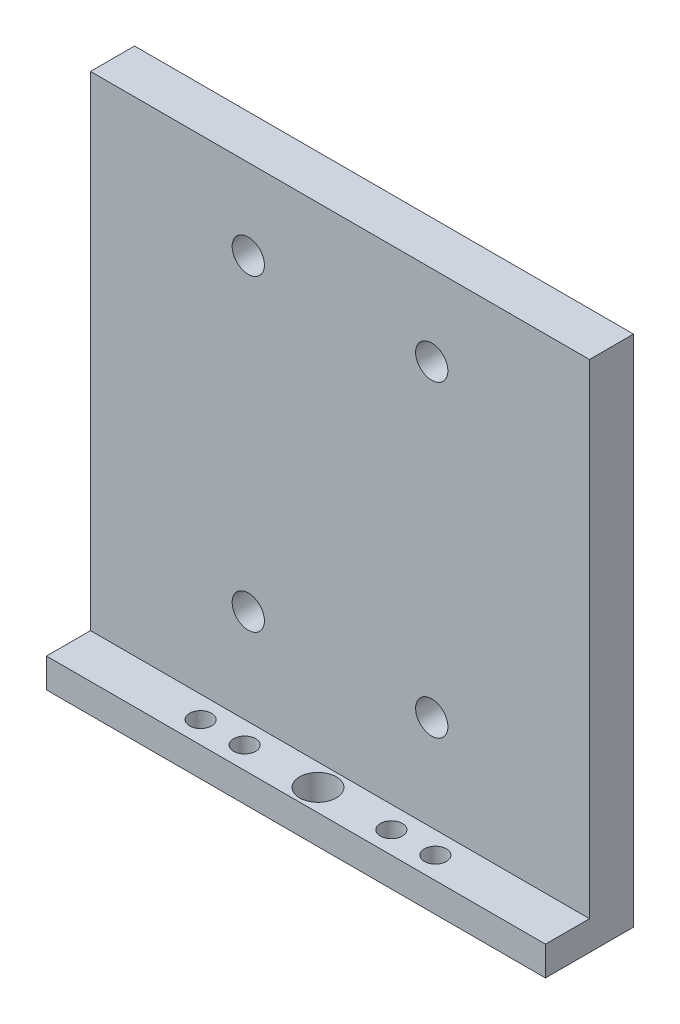
ISO-10303-21;
HEADER;
FILE_DESCRIPTION(('STEP AP214'),'2;1');
FILE_NAME('part.step','',(''),(''),'','','');
FILE_SCHEMA(('AUTOMOTIVE_DESIGN { 1 0 10303 214 1 1 1 1 }'));
ENDSEC;
DATA;
#1=APPLICATION_CONTEXT('core data for automotive mechanical design processes');
#2=APPLICATION_PROTOCOL_DEFINITION('international standard','automotive_design',2000,#1);
#3=PRODUCT_CONTEXT('',#1,'mechanical');
#4=PRODUCT('Part','Part','',(#3));
#5=PRODUCT_RELATED_PRODUCT_CATEGORY('part','',(#4));
#6=PRODUCT_DEFINITION_FORMATION('','',#4);
#7=PRODUCT_DEFINITION_CONTEXT('part definition',#1,'design');
#8=PRODUCT_DEFINITION('design','',#6,#7);
#9=PRODUCT_DEFINITION_SHAPE('','',#8);
#10=(LENGTH_UNIT() NAMED_UNIT(*) SI_UNIT(.MILLI.,.METRE.));
#11=(NAMED_UNIT(*) PLANE_ANGLE_UNIT() SI_UNIT($,.RADIAN.));
#12=(NAMED_UNIT(*) SI_UNIT($,.STERADIAN.) SOLID_ANGLE_UNIT());
#13=UNCERTAINTY_MEASURE_WITH_UNIT(LENGTH_MEASURE(1.E-05),#10,'distance_accuracy_value','');
#14=(GEOMETRIC_REPRESENTATION_CONTEXT(3) GLOBAL_UNCERTAINTY_ASSIGNED_CONTEXT((#13)) GLOBAL_UNIT_ASSIGNED_CONTEXT((#10,
#11,#12)) REPRESENTATION_CONTEXT('',''));
#15=CARTESIAN_POINT('',(0.,0.,0.));
#16=DIRECTION('',(0.,0.,1.));
#17=DIRECTION('',(1.,0.,0.));
#18=AXIS2_PLACEMENT_3D('',#15,#16,#17);
#19=CARTESIAN_POINT('',(34.,2.,0.));
#20=DIRECTION('',(0.,0.,-1.));
#21=DIRECTION('',(-1.,0.,0.));
#22=AXIS2_PLACEMENT_3D('',#19,#20,#21);
#23=PLANE('',#22);
#24=DIRECTION('',(0.,-1.,0.));
#25=VECTOR('',#24,1.);
#26=CARTESIAN_POINT('',(0.,2.,0.));
#27=LINE('',#26,#25);
#28=CARTESIAN_POINT('',(0.,2.,0.));
#29=VERTEX_POINT('',#28);
#30=CARTESIAN_POINT('',(0.,0.,0.));
#31=VERTEX_POINT('',#30);
#32=EDGE_CURVE('E120',#29,#31,#27,.T.);
#33=ORIENTED_EDGE('',*,*,#32,.T.);
#34=DIRECTION('',(-1.,0.,0.));
#35=VECTOR('',#34,1.);
#36=CARTESIAN_POINT('',(34.,0.,0.));
#37=LINE('',#36,#35);
#38=CARTESIAN_POINT('',(34.,0.,0.));
#39=VERTEX_POINT('',#38);
#40=EDGE_CURVE('E11',#39,#31,#37,.T.);
#41=ORIENTED_EDGE('',*,*,#40,.F.);
#42=DIRECTION('',(0.,-1.,0.));
#43=VECTOR('',#42,1.);
#44=CARTESIAN_POINT('',(34.,2.,0.));
#45=LINE('',#44,#43);
#46=CARTESIAN_POINT('',(34.,2.,0.));
#47=VERTEX_POINT('',#46);
#48=EDGE_CURVE('E131',#47,#39,#45,.T.);
#49=ORIENTED_EDGE('',*,*,#48,.F.);
#50=DIRECTION('',(-1.,0.,0.));
#51=VECTOR('',#50,1.);
#52=CARTESIAN_POINT('',(34.,2.,0.));
#53=LINE('',#52,#51);
#54=EDGE_CURVE('E116',#47,#29,#53,.T.);
#55=ORIENTED_EDGE('',*,*,#54,.T.);
#56=EDGE_LOOP('',(#33,#41,#49,#55));
#57=FACE_BOUND('',#56,.T.);
#58=ADVANCED_FACE('F36',(#57),#23,.F.);
#59=CARTESIAN_POINT('',(34.,0.,0.));
#60=DIRECTION('',(0.,1.,0.));
#61=DIRECTION('',(0.,0.,1.));
#62=AXIS2_PLACEMENT_3D('',#59,#60,#61);
#63=PLANE('',#62);
#64=CARTESIAN_POINT('',(9.,0.,-1.5));
#65=DIRECTION('',(0.,1.,0.));
#66=DIRECTION('',(0.,0.,1.));
#67=AXIS2_PLACEMENT_3D('',#64,#65,#66);
#68=CIRCLE('',#67,0.75);
#69=CARTESIAN_POINT('',(9.,0.,-0.75));
#70=VERTEX_POINT('',#69);
#71=EDGE_CURVE('E301',#70,#70,#68,.T.);
#72=ORIENTED_EDGE('',*,*,#71,.T.);
#73=EDGE_LOOP('',(#72));
#74=FACE_BOUND('',#73,.T.);
#75=CARTESIAN_POINT('',(12.,0.,-1.5));
#76=DIRECTION('',(0.,1.,0.));
#77=DIRECTION('',(0.,0.,1.));
#78=AXIS2_PLACEMENT_3D('',#75,#76,#77);
#79=CIRCLE('',#78,0.75);
#80=CARTESIAN_POINT('',(12.,0.,-0.75));
#81=VERTEX_POINT('',#80);
#82=EDGE_CURVE('E374',#81,#81,#79,.T.);
#83=ORIENTED_EDGE('',*,*,#82,.T.);
#84=EDGE_LOOP('',(#83));
#85=FACE_BOUND('',#84,.T.);
#86=CARTESIAN_POINT('',(25.,0.,-1.5));
#87=DIRECTION('',(0.,1.,0.));
#88=DIRECTION('',(0.,0.,1.));
#89=AXIS2_PLACEMENT_3D('',#86,#87,#88);
#90=CIRCLE('',#89,0.750000000000002);
#91=CARTESIAN_POINT('',(25.,0.,-0.749999999999998));
#92=VERTEX_POINT('',#91);
#93=EDGE_CURVE('E366',#92,#92,#90,.T.);
#94=ORIENTED_EDGE('',*,*,#93,.T.);
#95=EDGE_LOOP('',(#94));
#96=FACE_BOUND('',#95,.T.);
#97=CARTESIAN_POINT('',(22.,0.,-1.5));
#98=DIRECTION('',(0.,1.,0.));
#99=DIRECTION('',(0.,0.,1.));
#100=AXIS2_PLACEMENT_3D('',#97,#98,#99);
#101=CIRCLE('',#100,0.750000000000002);
#102=CARTESIAN_POINT('',(22.,0.,-0.749999999999998));
#103=VERTEX_POINT('',#102);
#104=EDGE_CURVE('E316',#103,#103,#101,.T.);
#105=ORIENTED_EDGE('',*,*,#104,.T.);
#106=EDGE_LOOP('',(#105));
#107=FACE_BOUND('',#106,.T.);
#108=CARTESIAN_POINT('',(17.,0.,-1.5));
#109=DIRECTION('',(0.,1.,0.));
#110=DIRECTION('',(0.,0.,1.));
#111=AXIS2_PLACEMENT_3D('',#108,#109,#110);
#112=CIRCLE('',#111,1.25);
#113=CARTESIAN_POINT('',(17.,0.,-0.250000000000002));
#114=VERTEX_POINT('',#113);
#115=EDGE_CURVE('E309',#114,#114,#112,.T.);
#116=ORIENTED_EDGE('',*,*,#115,.T.);
#117=EDGE_LOOP('',(#116));
#118=FACE_BOUND('',#117,.T.);
#119=DIRECTION('',(0.,0.,-1.));
#120=VECTOR('',#119,1.);
#121=CARTESIAN_POINT('',(0.,0.,0.));
#122=LINE('',#121,#120);
#123=CARTESIAN_POINT('',(0.,0.,-6.));
#124=VERTEX_POINT('',#123);
#125=EDGE_CURVE('E123',#31,#124,#122,.T.);
#126=ORIENTED_EDGE('',*,*,#125,.T.);
#127=DIRECTION('',(-1.,0.,0.));
#128=VECTOR('',#127,1.);
#129=CARTESIAN_POINT('',(34.,0.,-6.));
#130=LINE('',#129,#128);
#131=CARTESIAN_POINT('',(34.,0.,-6.));
#132=VERTEX_POINT('',#131);
#133=EDGE_CURVE('E44',#132,#124,#130,.T.);
#134=ORIENTED_EDGE('',*,*,#133,.F.);
#135=DIRECTION('',(0.,0.,-1.));
#136=VECTOR('',#135,1.);
#137=CARTESIAN_POINT('',(34.,0.,0.));
#138=LINE('',#137,#136);
#139=EDGE_CURVE('E89',#39,#132,#138,.T.);
#140=ORIENTED_EDGE('',*,*,#139,.F.);
#141=ORIENTED_EDGE('',*,*,#40,.T.);
#142=EDGE_LOOP('',(#126,#134,#140,#141));
#143=FACE_BOUND('',#142,.T.);
#144=ADVANCED_FACE('F159',(#74,#85,#96,#107,#118,#143),#63,.F.);
#145=CARTESIAN_POINT('',(34.,0.,-6.));
#146=DIRECTION('',(0.,0.,1.));
#147=DIRECTION('',(1.,0.,0.));
#148=AXIS2_PLACEMENT_3D('',#145,#146,#147);
#149=PLANE('',#148);
#150=CARTESIAN_POINT('',(23.25,8.5,-6.));
#151=DIRECTION('',(0.,0.,1.));
#152=DIRECTION('',(1.,0.,0.));
#153=AXIS2_PLACEMENT_3D('',#150,#151,#152);
#154=CIRCLE('',#153,1.1);
#155=CARTESIAN_POINT('',(24.35,8.5,-6.));
#156=VERTEX_POINT('',#155);
#157=EDGE_CURVE('E330',#156,#156,#154,.T.);
#158=ORIENTED_EDGE('',*,*,#157,.T.);
#159=EDGE_LOOP('',(#158));
#160=FACE_BOUND('',#159,.T.);
#161=CARTESIAN_POINT('',(10.75,8.5,-6.));
#162=DIRECTION('',(0.,0.,1.));
#163=DIRECTION('',(1.,0.,0.));
#164=AXIS2_PLACEMENT_3D('',#161,#162,#163);
#165=CIRCLE('',#164,1.1);
#166=CARTESIAN_POINT('',(11.85,8.5,-6.));
#167=VERTEX_POINT('',#166);
#168=EDGE_CURVE('E324',#167,#167,#165,.T.);
#169=ORIENTED_EDGE('',*,*,#168,.T.);
#170=EDGE_LOOP('',(#169));
#171=FACE_BOUND('',#170,.T.);
#172=CARTESIAN_POINT('',(10.75,29.5,-6.));
#173=DIRECTION('',(0.,0.,1.));
#174=DIRECTION('',(1.,0.,0.));
#175=AXIS2_PLACEMENT_3D('',#172,#173,#174);
#176=CIRCLE('',#175,1.1);
#177=CARTESIAN_POINT('',(11.85,29.5,-6.));
#178=VERTEX_POINT('',#177);
#179=EDGE_CURVE('E317',#178,#178,#176,.T.);
#180=ORIENTED_EDGE('',*,*,#179,.T.);
#181=EDGE_LOOP('',(#180));
#182=FACE_BOUND('',#181,.T.);
#183=CARTESIAN_POINT('',(23.25,29.5,-6.));
#184=DIRECTION('',(0.,0.,1.));
#185=DIRECTION('',(1.,0.,0.));
#186=AXIS2_PLACEMENT_3D('',#183,#184,#185);
#187=CIRCLE('',#186,1.1);
#188=CARTESIAN_POINT('',(24.35,29.5,-6.));
#189=VERTEX_POINT('',#188);
#190=EDGE_CURVE('E124',#189,#189,#187,.T.);
#191=ORIENTED_EDGE('',*,*,#190,.T.);
#192=EDGE_LOOP('',(#191));
#193=FACE_BOUND('',#192,.T.);
#194=DIRECTION('',(0.,1.,0.));
#195=VECTOR('',#194,1.);
#196=CARTESIAN_POINT('',(0.,0.,-6.));
#197=LINE('',#196,#195);
#198=CARTESIAN_POINT('',(0.,35.,-6.));
#199=VERTEX_POINT('',#198);
#200=EDGE_CURVE('E126',#124,#199,#197,.T.);
#201=ORIENTED_EDGE('',*,*,#200,.T.);
#202=DIRECTION('',(-1.,0.,0.));
#203=VECTOR('',#202,1.);
#204=CARTESIAN_POINT('',(34.,35.,-6.));
#205=LINE('',#204,#203);
#206=CARTESIAN_POINT('',(34.,35.,-6.));
#207=VERTEX_POINT('',#206);
#208=EDGE_CURVE('E111',#207,#199,#205,.T.);
#209=ORIENTED_EDGE('',*,*,#208,.F.);
#210=DIRECTION('',(0.,1.,0.));
#211=VECTOR('',#210,1.);
#212=CARTESIAN_POINT('',(34.,0.,-6.));
#213=LINE('',#212,#211);
#214=EDGE_CURVE('E102',#132,#207,#213,.T.);
#215=ORIENTED_EDGE('',*,*,#214,.F.);
#216=ORIENTED_EDGE('',*,*,#133,.T.);
#217=EDGE_LOOP('',(#201,#209,#215,#216));
#218=FACE_BOUND('',#217,.T.);
#219=ADVANCED_FACE('F137',(#160,#171,#182,#193,#218),#149,.F.);
#220=CARTESIAN_POINT('',(34.,35.,-6.));
#221=DIRECTION('',(0.,-1.,0.));
#222=DIRECTION('',(0.,0.,-1.));
#223=AXIS2_PLACEMENT_3D('',#220,#221,#222);
#224=PLANE('',#223);
#225=DIRECTION('',(0.,0.,1.));
#226=VECTOR('',#225,1.);
#227=CARTESIAN_POINT('',(0.,35.,-6.));
#228=LINE('',#227,#226);
#229=CARTESIAN_POINT('',(0.,35.,-3.));
#230=VERTEX_POINT('',#229);
#231=EDGE_CURVE('E110',#199,#230,#228,.T.);
#232=ORIENTED_EDGE('',*,*,#231,.T.);
#233=DIRECTION('',(-1.,0.,0.));
#234=VECTOR('',#233,1.);
#235=CARTESIAN_POINT('',(34.,35.,-3.));
#236=LINE('',#235,#234);
#237=CARTESIAN_POINT('',(34.,35.,-3.));
#238=VERTEX_POINT('',#237);
#239=EDGE_CURVE('E107',#238,#230,#236,.T.);
#240=ORIENTED_EDGE('',*,*,#239,.F.);
#241=DIRECTION('',(0.,0.,1.));
#242=VECTOR('',#241,1.);
#243=CARTESIAN_POINT('',(34.,35.,-6.));
#244=LINE('',#243,#242);
#245=EDGE_CURVE('E96',#207,#238,#244,.T.);
#246=ORIENTED_EDGE('',*,*,#245,.F.);
#247=ORIENTED_EDGE('',*,*,#208,.T.);
#248=EDGE_LOOP('',(#232,#240,#246,#247));
#249=FACE_BOUND('',#248,.T.);
#250=ADVANCED_FACE('F108',(#249),#224,.F.);
#251=CARTESIAN_POINT('',(34.,35.,-3.));
#252=DIRECTION('',(0.,0.,-1.));
#253=DIRECTION('',(0.,1.,0.));
#254=AXIS2_PLACEMENT_3D('',#251,#252,#253);
#255=PLANE('',#254);
#256=CARTESIAN_POINT('',(23.25,8.5,-3.));
#257=DIRECTION('',(0.,0.,1.));
#258=DIRECTION('',(1.,0.,0.));
#259=AXIS2_PLACEMENT_3D('',#256,#257,#258);
#260=CIRCLE('',#259,1.1);
#261=CARTESIAN_POINT('',(24.35,8.5,-3.));
#262=VERTEX_POINT('',#261);
#263=EDGE_CURVE('E312',#262,#262,#260,.T.);
#264=ORIENTED_EDGE('',*,*,#263,.F.);
#265=EDGE_LOOP('',(#264));
#266=FACE_BOUND('',#265,.T.);
#267=CARTESIAN_POINT('',(10.75,8.5,-3.));
#268=DIRECTION('',(0.,0.,1.));
#269=DIRECTION('',(1.,0.,0.));
#270=AXIS2_PLACEMENT_3D('',#267,#268,#269);
#271=CIRCLE('',#270,1.1);
#272=CARTESIAN_POINT('',(11.85,8.5,-3.));
#273=VERTEX_POINT('',#272);
#274=EDGE_CURVE('E327',#273,#273,#271,.T.);
#275=ORIENTED_EDGE('',*,*,#274,.F.);
#276=EDGE_LOOP('',(#275));
#277=FACE_BOUND('',#276,.T.);
#278=CARTESIAN_POINT('',(10.75,29.5,-3.));
#279=DIRECTION('',(0.,0.,1.));
#280=DIRECTION('',(1.,0.,0.));
#281=AXIS2_PLACEMENT_3D('',#278,#279,#280);
#282=CIRCLE('',#281,1.1);
#283=CARTESIAN_POINT('',(11.85,29.5,-3.));
#284=VERTEX_POINT('',#283);
#285=EDGE_CURVE('E321',#284,#284,#282,.T.);
#286=ORIENTED_EDGE('',*,*,#285,.F.);
#287=EDGE_LOOP('',(#286));
#288=FACE_BOUND('',#287,.T.);
#289=CARTESIAN_POINT('',(23.25,29.5,-3.));
#290=DIRECTION('',(0.,0.,1.));
#291=DIRECTION('',(1.,0.,0.));
#292=AXIS2_PLACEMENT_3D('',#289,#290,#291);
#293=CIRCLE('',#292,1.1);
#294=CARTESIAN_POINT('',(24.35,29.5,-3.));
#295=VERTEX_POINT('',#294);
#296=EDGE_CURVE('E320',#295,#295,#293,.T.);
#297=ORIENTED_EDGE('',*,*,#296,.F.);
#298=EDGE_LOOP('',(#297));
#299=FACE_BOUND('',#298,.T.);
#300=DIRECTION('',(0.,-1.,0.));
#301=VECTOR('',#300,1.);
#302=CARTESIAN_POINT('',(0.,35.,-3.));
#303=LINE('',#302,#301);
#304=CARTESIAN_POINT('',(0.,2.,-3.));
#305=VERTEX_POINT('',#304);
#306=EDGE_CURVE('E75',#230,#305,#303,.T.);
#307=ORIENTED_EDGE('',*,*,#306,.T.);
#308=DIRECTION('',(-1.,0.,0.));
#309=VECTOR('',#308,1.);
#310=CARTESIAN_POINT('',(34.,2.,-3.));
#311=LINE('',#310,#309);
#312=CARTESIAN_POINT('',(34.,2.,-3.));
#313=VERTEX_POINT('',#312);
#314=EDGE_CURVE('E112',#313,#305,#311,.T.);
#315=ORIENTED_EDGE('',*,*,#314,.F.);
#316=DIRECTION('',(0.,-1.,0.));
#317=VECTOR('',#316,1.);
#318=CARTESIAN_POINT('',(34.,35.,-3.));
#319=LINE('',#318,#317);
#320=EDGE_CURVE('E100',#238,#313,#319,.T.);
#321=ORIENTED_EDGE('',*,*,#320,.F.);
#322=ORIENTED_EDGE('',*,*,#239,.T.);
#323=EDGE_LOOP('',(#307,#315,#321,#322));
#324=FACE_BOUND('',#323,.T.);
#325=ADVANCED_FACE('F114',(#266,#277,#288,#299,#324),#255,.F.);
#326=CARTESIAN_POINT('',(34.,2.,-3.));
#327=DIRECTION('',(0.,-1.,0.));
#328=DIRECTION('',(0.,0.,-1.));
#329=AXIS2_PLACEMENT_3D('',#326,#327,#328);
#330=PLANE('',#329);
#331=CARTESIAN_POINT('',(9.,2.,-1.5));
#332=DIRECTION('',(0.,1.,0.));
#333=DIRECTION('',(0.,0.,1.));
#334=AXIS2_PLACEMENT_3D('',#331,#332,#333);
#335=CIRCLE('',#334,0.75);
#336=CARTESIAN_POINT('',(9.,2.,-0.75));
#337=VERTEX_POINT('',#336);
#338=EDGE_CURVE('E303',#337,#337,#335,.T.);
#339=ORIENTED_EDGE('',*,*,#338,.F.);
#340=EDGE_LOOP('',(#339));
#341=FACE_BOUND('',#340,.T.);
#342=CARTESIAN_POINT('',(12.,2.,-1.5));
#343=DIRECTION('',(0.,1.,0.));
#344=DIRECTION('',(0.,0.,1.));
#345=AXIS2_PLACEMENT_3D('',#342,#343,#344);
#346=CIRCLE('',#345,0.75);
#347=CARTESIAN_POINT('',(12.,2.,-0.75));
#348=VERTEX_POINT('',#347);
#349=EDGE_CURVE('E305',#348,#348,#346,.T.);
#350=ORIENTED_EDGE('',*,*,#349,.F.);
#351=EDGE_LOOP('',(#350));
#352=FACE_BOUND('',#351,.T.);
#353=CARTESIAN_POINT('',(25.,2.,-1.5));
#354=DIRECTION('',(0.,1.,0.));
#355=DIRECTION('',(0.,0.,1.));
#356=AXIS2_PLACEMENT_3D('',#353,#354,#355);
#357=CIRCLE('',#356,0.750000000000002);
#358=CARTESIAN_POINT('',(25.,2.,-0.749999999999998));
#359=VERTEX_POINT('',#358);
#360=EDGE_CURVE('E371',#359,#359,#357,.T.);
#361=ORIENTED_EDGE('',*,*,#360,.F.);
#362=EDGE_LOOP('',(#361));
#363=FACE_BOUND('',#362,.T.);
#364=CARTESIAN_POINT('',(22.,2.,-1.5));
#365=DIRECTION('',(0.,1.,0.));
#366=DIRECTION('',(0.,0.,1.));
#367=AXIS2_PLACEMENT_3D('',#364,#365,#366);
#368=CIRCLE('',#367,0.750000000000002);
#369=CARTESIAN_POINT('',(22.,2.,-0.749999999999998));
#370=VERTEX_POINT('',#369);
#371=EDGE_CURVE('E361',#370,#370,#368,.T.);
#372=ORIENTED_EDGE('',*,*,#371,.F.);
#373=EDGE_LOOP('',(#372));
#374=FACE_BOUND('',#373,.T.);
#375=CARTESIAN_POINT('',(17.,2.,-1.5));
#376=DIRECTION('',(0.,1.,0.));
#377=DIRECTION('',(0.,0.,1.));
#378=AXIS2_PLACEMENT_3D('',#375,#376,#377);
#379=CIRCLE('',#378,1.25);
#380=CARTESIAN_POINT('',(17.,2.,-0.250000000000003));
#381=VERTEX_POINT('',#380);
#382=EDGE_CURVE('E313',#381,#381,#379,.T.);
#383=ORIENTED_EDGE('',*,*,#382,.F.);
#384=EDGE_LOOP('',(#383));
#385=FACE_BOUND('',#384,.T.);
#386=DIRECTION('',(0.,0.,1.));
#387=VECTOR('',#386,1.);
#388=CARTESIAN_POINT('',(0.,2.,-3.));
#389=LINE('',#388,#387);
#390=EDGE_CURVE('E81',#305,#29,#389,.T.);
#391=ORIENTED_EDGE('',*,*,#390,.T.);
#392=ORIENTED_EDGE('',*,*,#54,.F.);
#393=DIRECTION('',(0.,0.,1.));
#394=VECTOR('',#393,1.);
#395=CARTESIAN_POINT('',(34.,2.,-3.));
#396=LINE('',#395,#394);
#397=EDGE_CURVE('E52',#313,#47,#396,.T.);
#398=ORIENTED_EDGE('',*,*,#397,.F.);
#399=ORIENTED_EDGE('',*,*,#314,.T.);
#400=EDGE_LOOP('',(#391,#392,#398,#399));
#401=FACE_BOUND('',#400,.T.);
#402=ADVANCED_FACE('F144',(#341,#352,#363,#374,#385,#401),#330,.F.);
#403=CARTESIAN_POINT('',(34.,0.,0.));
#404=DIRECTION('',(1.,0.,0.));
#405=DIRECTION('',(0.,0.,-1.));
#406=AXIS2_PLACEMENT_3D('',#403,#404,#405);
#407=PLANE('',#406);
#408=ORIENTED_EDGE('',*,*,#48,.T.);
#409=ORIENTED_EDGE('',*,*,#139,.T.);
#410=ORIENTED_EDGE('',*,*,#214,.T.);
#411=ORIENTED_EDGE('',*,*,#245,.T.);
#412=ORIENTED_EDGE('',*,*,#320,.T.);
#413=ORIENTED_EDGE('',*,*,#397,.T.);
#414=EDGE_LOOP('',(#408,#409,#410,#411,#412,#413));
#415=FACE_BOUND('',#414,.T.);
#416=ADVANCED_FACE('F98',(#415),#407,.T.);
#417=CARTESIAN_POINT('',(0.,0.,0.));
#418=DIRECTION('',(1.,0.,0.));
#419=DIRECTION('',(0.,0.,-1.));
#420=AXIS2_PLACEMENT_3D('',#417,#418,#419);
#421=PLANE('',#420);
#422=ORIENTED_EDGE('',*,*,#32,.F.);
#423=ORIENTED_EDGE('',*,*,#390,.F.);
#424=ORIENTED_EDGE('',*,*,#306,.F.);
#425=ORIENTED_EDGE('',*,*,#231,.F.);
#426=ORIENTED_EDGE('',*,*,#200,.F.);
#427=ORIENTED_EDGE('',*,*,#125,.F.);
#428=EDGE_LOOP('',(#422,#423,#424,#425,#426,#427));
#429=FACE_BOUND('',#428,.T.);
#430=ADVANCED_FACE('F140',(#429),#421,.F.);
#431=CARTESIAN_POINT('',(23.25,29.5,-6.));
#432=DIRECTION('',(0.,0.,1.));
#433=DIRECTION('',(1.,0.,0.));
#434=AXIS2_PLACEMENT_3D('',#431,#432,#433);
#435=CYLINDRICAL_SURFACE('',#434,1.1);
#436=ORIENTED_EDGE('',*,*,#190,.F.);
#437=EDGE_LOOP('',(#436));
#438=FACE_BOUND('',#437,.T.);
#439=ORIENTED_EDGE('',*,*,#296,.T.);
#440=EDGE_LOOP('',(#439));
#441=FACE_BOUND('',#440,.T.);
#442=ADVANCED_FACE('F191',(#438,#441),#435,.F.);
#443=CARTESIAN_POINT('',(10.75,29.5,-6.));
#444=DIRECTION('',(0.,0.,1.));
#445=DIRECTION('',(1.,0.,0.));
#446=AXIS2_PLACEMENT_3D('',#443,#444,#445);
#447=CYLINDRICAL_SURFACE('',#446,1.1);
#448=ORIENTED_EDGE('',*,*,#179,.F.);
#449=EDGE_LOOP('',(#448));
#450=FACE_BOUND('',#449,.T.);
#451=ORIENTED_EDGE('',*,*,#285,.T.);
#452=EDGE_LOOP('',(#451));
#453=FACE_BOUND('',#452,.T.);
#454=ADVANCED_FACE('F196',(#450,#453),#447,.F.);
#455=CARTESIAN_POINT('',(10.75,8.5,-6.));
#456=DIRECTION('',(0.,0.,1.));
#457=DIRECTION('',(1.,0.,0.));
#458=AXIS2_PLACEMENT_3D('',#455,#456,#457);
#459=CYLINDRICAL_SURFACE('',#458,1.1);
#460=ORIENTED_EDGE('',*,*,#168,.F.);
#461=EDGE_LOOP('',(#460));
#462=FACE_BOUND('',#461,.T.);
#463=ORIENTED_EDGE('',*,*,#274,.T.);
#464=EDGE_LOOP('',(#463));
#465=FACE_BOUND('',#464,.T.);
#466=ADVANCED_FACE('F208',(#462,#465),#459,.F.);
#467=CARTESIAN_POINT('',(23.25,8.5,-6.));
#468=DIRECTION('',(0.,0.,1.));
#469=DIRECTION('',(1.,0.,0.));
#470=AXIS2_PLACEMENT_3D('',#467,#468,#469);
#471=CYLINDRICAL_SURFACE('',#470,1.1);
#472=ORIENTED_EDGE('',*,*,#157,.F.);
#473=EDGE_LOOP('',(#472));
#474=FACE_BOUND('',#473,.T.);
#475=ORIENTED_EDGE('',*,*,#263,.T.);
#476=EDGE_LOOP('',(#475));
#477=FACE_BOUND('',#476,.T.);
#478=ADVANCED_FACE('F218',(#474,#477),#471,.F.);
#479=CARTESIAN_POINT('',(17.,0.,-1.5));
#480=DIRECTION('',(0.,1.,0.));
#481=DIRECTION('',(0.,0.,1.));
#482=AXIS2_PLACEMENT_3D('',#479,#480,#481);
#483=CYLINDRICAL_SURFACE('',#482,1.25);
#484=ORIENTED_EDGE('',*,*,#115,.F.);
#485=EDGE_LOOP('',(#484));
#486=FACE_BOUND('',#485,.T.);
#487=ORIENTED_EDGE('',*,*,#382,.T.);
#488=EDGE_LOOP('',(#487));
#489=FACE_BOUND('',#488,.T.);
#490=ADVANCED_FACE('F227',(#486,#489),#483,.F.);
#491=CARTESIAN_POINT('',(22.,0.,-1.5));
#492=DIRECTION('',(0.,1.,0.));
#493=DIRECTION('',(0.,0.,1.));
#494=AXIS2_PLACEMENT_3D('',#491,#492,#493);
#495=CYLINDRICAL_SURFACE('',#494,0.750000000000002);
#496=ORIENTED_EDGE('',*,*,#104,.F.);
#497=EDGE_LOOP('',(#496));
#498=FACE_BOUND('',#497,.T.);
#499=ORIENTED_EDGE('',*,*,#371,.T.);
#500=EDGE_LOOP('',(#499));
#501=FACE_BOUND('',#500,.T.);
#502=ADVANCED_FACE('F247',(#498,#501),#495,.F.);
#503=CARTESIAN_POINT('',(25.,0.,-1.5));
#504=DIRECTION('',(0.,1.,0.));
#505=DIRECTION('',(0.,0.,1.));
#506=AXIS2_PLACEMENT_3D('',#503,#504,#505);
#507=CYLINDRICAL_SURFACE('',#506,0.750000000000002);
#508=ORIENTED_EDGE('',*,*,#93,.F.);
#509=EDGE_LOOP('',(#508));
#510=FACE_BOUND('',#509,.T.);
#511=ORIENTED_EDGE('',*,*,#360,.T.);
#512=EDGE_LOOP('',(#511));
#513=FACE_BOUND('',#512,.T.);
#514=ADVANCED_FACE('F257',(#510,#513),#507,.F.);
#515=CARTESIAN_POINT('',(12.,0.,-1.5));
#516=DIRECTION('',(0.,1.,0.));
#517=DIRECTION('',(0.,0.,1.));
#518=AXIS2_PLACEMENT_3D('',#515,#516,#517);
#519=CYLINDRICAL_SURFACE('',#518,0.75);
#520=ORIENTED_EDGE('',*,*,#82,.F.);
#521=EDGE_LOOP('',(#520));
#522=FACE_BOUND('',#521,.T.);
#523=ORIENTED_EDGE('',*,*,#349,.T.);
#524=EDGE_LOOP('',(#523));
#525=FACE_BOUND('',#524,.T.);
#526=ADVANCED_FACE('F267',(#522,#525),#519,.F.);
#527=CARTESIAN_POINT('',(9.,0.,-1.5));
#528=DIRECTION('',(0.,1.,0.));
#529=DIRECTION('',(0.,0.,1.));
#530=AXIS2_PLACEMENT_3D('',#527,#528,#529);
#531=CYLINDRICAL_SURFACE('',#530,0.75);
#532=ORIENTED_EDGE('',*,*,#71,.F.);
#533=EDGE_LOOP('',(#532));
#534=FACE_BOUND('',#533,.T.);
#535=ORIENTED_EDGE('',*,*,#338,.T.);
#536=EDGE_LOOP('',(#535));
#537=FACE_BOUND('',#536,.T.);
#538=ADVANCED_FACE('F277',(#534,#537),#531,.F.);
#539=CLOSED_SHELL('',(#58,#144,#219,#250,#325,#402,#416,#430,#442,#454,#466,#478,#490,#502,#514,
#526,#538));
#540=MANIFOLD_SOLID_BREP('B2',#539);
#541=ADVANCED_BREP_SHAPE_REPRESENTATION('',(#18,#540),#14);
#542=SHAPE_DEFINITION_REPRESENTATION(#9,#541);
ENDSEC;
END-ISO-10303-21;
